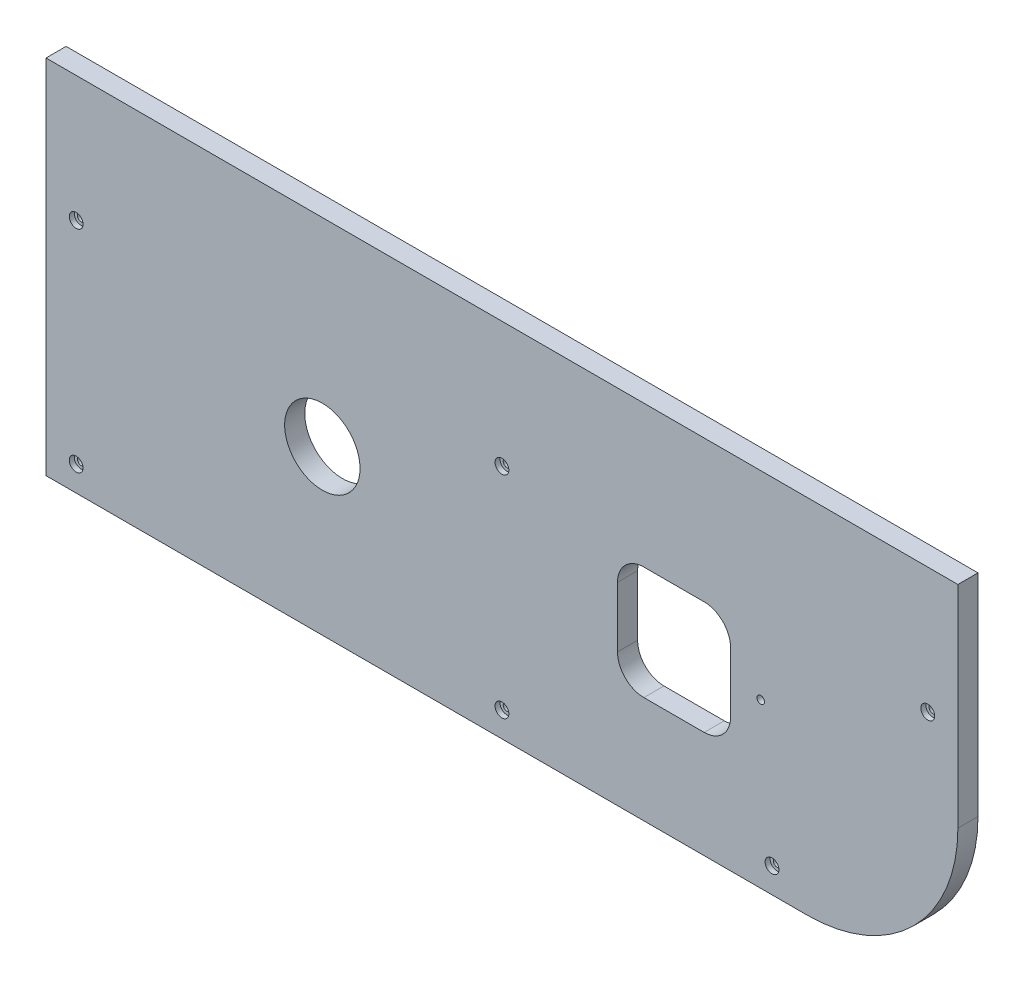
ISO-10303-21;
HEADER;
FILE_DESCRIPTION(('STEP AP214'),'2;1');
FILE_NAME('part.step','',(''),(''),'','','');
FILE_SCHEMA(('AUTOMOTIVE_DESIGN { 1 0 10303 214 1 1 1 1 }'));
ENDSEC;
DATA;
#1=APPLICATION_CONTEXT('core data for automotive mechanical design processes');
#2=APPLICATION_PROTOCOL_DEFINITION('international standard','automotive_design',2000,#1);
#3=PRODUCT_CONTEXT('',#1,'mechanical');
#4=PRODUCT('Part','Part','',(#3));
#5=PRODUCT_RELATED_PRODUCT_CATEGORY('part','',(#4));
#6=PRODUCT_DEFINITION_FORMATION('','',#4);
#7=PRODUCT_DEFINITION_CONTEXT('part definition',#1,'design');
#8=PRODUCT_DEFINITION('design','',#6,#7);
#9=PRODUCT_DEFINITION_SHAPE('','',#8);
#10=(LENGTH_UNIT() NAMED_UNIT(*) SI_UNIT(.MILLI.,.METRE.));
#11=(NAMED_UNIT(*) PLANE_ANGLE_UNIT() SI_UNIT($,.RADIAN.));
#12=(NAMED_UNIT(*) SI_UNIT($,.STERADIAN.) SOLID_ANGLE_UNIT());
#13=UNCERTAINTY_MEASURE_WITH_UNIT(LENGTH_MEASURE(1.E-05),#10,'distance_accuracy_value','');
#14=(GEOMETRIC_REPRESENTATION_CONTEXT(3) GLOBAL_UNCERTAINTY_ASSIGNED_CONTEXT((#13)) GLOBAL_UNIT_ASSIGNED_CONTEXT((#10,
#11,#12)) REPRESENTATION_CONTEXT('',''));
#15=CARTESIAN_POINT('',(0.,0.,0.));
#16=DIRECTION('',(0.,0.,1.));
#17=DIRECTION('',(1.,0.,0.));
#18=AXIS2_PLACEMENT_3D('',#15,#16,#17);
#19=CARTESIAN_POINT('',(-162.,-49.,8.));
#20=DIRECTION('',(1.,0.,0.));
#21=DIRECTION('',(0.,1.,0.));
#22=AXIS2_PLACEMENT_3D('',#19,#20,#21);
#23=PLANE('',#22);
#24=DIRECTION('',(0.,-1.,0.));
#25=VECTOR('',#24,1.);
#26=CARTESIAN_POINT('',(-162.,-49.,0.));
#27=LINE('',#26,#25);
#28=CARTESIAN_POINT('',(-162.,-49.,0.));
#29=VERTEX_POINT('',#28);
#30=CARTESIAN_POINT('',(-162.,-193.00000000004,0.));
#31=VERTEX_POINT('',#30);
#32=EDGE_CURVE('E219',#29,#31,#27,.T.);
#33=ORIENTED_EDGE('',*,*,#32,.T.);
#34=DIRECTION('',(0.,0.,-1.));
#35=VECTOR('',#34,1.);
#36=CARTESIAN_POINT('',(-162.,-193.00000000004,8.));
#37=LINE('',#36,#35);
#38=CARTESIAN_POINT('',(-162.,-193.00000000004,8.));
#39=VERTEX_POINT('',#38);
#40=EDGE_CURVE('E11',#39,#31,#37,.T.);
#41=ORIENTED_EDGE('',*,*,#40,.F.);
#42=DIRECTION('',(0.,-1.,0.));
#43=VECTOR('',#42,1.);
#44=CARTESIAN_POINT('',(-162.,-49.,8.));
#45=LINE('',#44,#43);
#46=CARTESIAN_POINT('',(-162.,-49.,8.));
#47=VERTEX_POINT('',#46);
#48=EDGE_CURVE('E206',#47,#39,#45,.T.);
#49=ORIENTED_EDGE('',*,*,#48,.F.);
#50=DIRECTION('',(0.,0.,-1.));
#51=VECTOR('',#50,1.);
#52=CARTESIAN_POINT('',(-162.,-49.,8.));
#53=LINE('',#52,#51);
#54=EDGE_CURVE('E218',#47,#29,#53,.T.);
#55=ORIENTED_EDGE('',*,*,#54,.T.);
#56=EDGE_LOOP('',(#33,#41,#49,#55));
#57=FACE_BOUND('',#56,.T.);
#58=ADVANCED_FACE('F34',(#57),#23,.F.);
#59=CARTESIAN_POINT('',(-162.,-193.00000000004,8.));
#60=DIRECTION('',(0.,1.,0.));
#61=DIRECTION('',(0.,0.,1.));
#62=AXIS2_PLACEMENT_3D('',#59,#60,#61);
#63=PLANE('',#62);
#64=DIRECTION('',(1.,0.,0.));
#65=VECTOR('',#64,1.);
#66=CARTESIAN_POINT('',(-162.,-193.00000000004,0.));
#67=LINE('',#66,#65);
#68=CARTESIAN_POINT('',(141.,-193.00000000004,0.));
#69=VERTEX_POINT('',#68);
#70=EDGE_CURVE('E222',#31,#69,#67,.T.);
#71=ORIENTED_EDGE('',*,*,#70,.T.);
#72=DIRECTION('',(0.,0.,-1.));
#73=VECTOR('',#72,1.);
#74=CARTESIAN_POINT('',(141.,-193.00000000004,8.));
#75=LINE('',#74,#73);
#76=CARTESIAN_POINT('',(141.,-193.00000000004,8.));
#77=VERTEX_POINT('',#76);
#78=EDGE_CURVE('E41',#77,#69,#75,.T.);
#79=ORIENTED_EDGE('',*,*,#78,.F.);
#80=DIRECTION('',(1.,0.,0.));
#81=VECTOR('',#80,1.);
#82=CARTESIAN_POINT('',(-162.,-193.00000000004,8.));
#83=LINE('',#82,#81);
#84=EDGE_CURVE('E209',#39,#77,#83,.T.);
#85=ORIENTED_EDGE('',*,*,#84,.F.);
#86=ORIENTED_EDGE('',*,*,#40,.T.);
#87=EDGE_LOOP('',(#71,#79,#85,#86));
#88=FACE_BOUND('',#87,.T.);
#89=ADVANCED_FACE('F261',(#88),#63,.F.);
#90=CARTESIAN_POINT('',(141.,-133.00000000004,8.));
#91=DIRECTION('',(0.,0.,-1.));
#92=DIRECTION('',(-1.,0.,0.));
#93=AXIS2_PLACEMENT_3D('',#90,#91,#92);
#94=CYLINDRICAL_SURFACE('',#93,60.);
#95=CARTESIAN_POINT('',(141.,-133.00000000004,0.));
#96=DIRECTION('',(0.,0.,1.));
#97=DIRECTION('',(1.,0.,0.));
#98=AXIS2_PLACEMENT_3D('',#95,#96,#97);
#99=CIRCLE('',#98,60.);
#100=CARTESIAN_POINT('',(201.,-133.00000000004,0.));
#101=VERTEX_POINT('',#100);
#102=EDGE_CURVE('E225',#69,#101,#99,.T.);
#103=ORIENTED_EDGE('',*,*,#102,.T.);
#104=DIRECTION('',(0.,0.,-1.));
#105=VECTOR('',#104,1.);
#106=CARTESIAN_POINT('',(201.,-133.00000000004,8.));
#107=LINE('',#106,#105);
#108=CARTESIAN_POINT('',(201.,-133.00000000004,8.));
#109=VERTEX_POINT('',#108);
#110=EDGE_CURVE('E235',#109,#101,#107,.T.);
#111=ORIENTED_EDGE('',*,*,#110,.F.);
#112=CARTESIAN_POINT('',(141.,-133.00000000004,8.));
#113=DIRECTION('',(0.,0.,1.));
#114=DIRECTION('',(1.,0.,0.));
#115=AXIS2_PLACEMENT_3D('',#112,#113,#114);
#116=CIRCLE('',#115,60.);
#117=EDGE_CURVE('E212',#77,#109,#116,.T.);
#118=ORIENTED_EDGE('',*,*,#117,.F.);
#119=ORIENTED_EDGE('',*,*,#78,.T.);
#120=EDGE_LOOP('',(#103,#111,#118,#119));
#121=FACE_BOUND('',#120,.T.);
#122=ADVANCED_FACE('F242',(#121),#94,.T.);
#123=CARTESIAN_POINT('',(201.,-49.,8.));
#124=DIRECTION('',(-1.,0.,0.));
#125=DIRECTION('',(0.,-1.,0.));
#126=AXIS2_PLACEMENT_3D('',#123,#124,#125);
#127=PLANE('',#126);
#128=DIRECTION('',(0.,1.,0.));
#129=VECTOR('',#128,1.);
#130=CARTESIAN_POINT('',(201.,-49.,0.));
#131=LINE('',#130,#129);
#132=CARTESIAN_POINT('',(201.,-49.,0.));
#133=VERTEX_POINT('',#132);
#134=EDGE_CURVE('E227',#101,#133,#131,.T.);
#135=ORIENTED_EDGE('',*,*,#134,.T.);
#136=DIRECTION('',(0.,0.,-1.));
#137=VECTOR('',#136,1.);
#138=CARTESIAN_POINT('',(201.,-49.,8.));
#139=LINE('',#138,#137);
#140=CARTESIAN_POINT('',(201.,-49.,8.));
#141=VERTEX_POINT('',#140);
#142=EDGE_CURVE('E232',#141,#133,#139,.T.);
#143=ORIENTED_EDGE('',*,*,#142,.F.);
#144=DIRECTION('',(0.,1.,0.));
#145=VECTOR('',#144,1.);
#146=CARTESIAN_POINT('',(201.,-49.,8.));
#147=LINE('',#146,#145);
#148=EDGE_CURVE('E214',#109,#141,#147,.T.);
#149=ORIENTED_EDGE('',*,*,#148,.F.);
#150=ORIENTED_EDGE('',*,*,#110,.T.);
#151=EDGE_LOOP('',(#135,#143,#149,#150));
#152=FACE_BOUND('',#151,.T.);
#153=ADVANCED_FACE('F251',(#152),#127,.F.);
#154=CARTESIAN_POINT('',(-162.,-49.,8.));
#155=DIRECTION('',(0.,-1.,0.));
#156=DIRECTION('',(1.,0.,0.));
#157=AXIS2_PLACEMENT_3D('',#154,#155,#156);
#158=PLANE('',#157);
#159=DIRECTION('',(-1.,0.,0.));
#160=VECTOR('',#159,1.);
#161=CARTESIAN_POINT('',(-162.,-49.,0.));
#162=LINE('',#161,#160);
#163=EDGE_CURVE('E210',#133,#29,#162,.T.);
#164=ORIENTED_EDGE('',*,*,#163,.T.);
#165=ORIENTED_EDGE('',*,*,#54,.F.);
#166=DIRECTION('',(-1.,0.,0.));
#167=VECTOR('',#166,1.);
#168=CARTESIAN_POINT('',(-162.,-49.,8.));
#169=LINE('',#168,#167);
#170=EDGE_CURVE('E216',#141,#47,#169,.T.);
#171=ORIENTED_EDGE('',*,*,#170,.F.);
#172=ORIENTED_EDGE('',*,*,#142,.T.);
#173=EDGE_LOOP('',(#164,#165,#171,#172));
#174=FACE_BOUND('',#173,.T.);
#175=ADVANCED_FACE('F255',(#174),#158,.F.);
#176=CARTESIAN_POINT('',(141.,-133.00000000004,8.));
#177=DIRECTION('',(0.,0.,1.));
#178=DIRECTION('',(1.,0.,0.));
#179=AXIS2_PLACEMENT_3D('',#176,#177,#178);
#180=PLANE('',#179);
#181=CARTESIAN_POINT('',(-150.,-98.9999999999999,8.));
#182=DIRECTION('',(0.,0.,1.));
#183=DIRECTION('',(1.,0.,0.));
#184=AXIS2_PLACEMENT_3D('',#181,#182,#183);
#185=CIRCLE('',#184,2.75);
#186=CARTESIAN_POINT('',(-147.25,-98.9999999999999,8.));
#187=VERTEX_POINT('',#186);
#188=EDGE_CURVE('E396',#187,#187,#185,.T.);
#189=ORIENTED_EDGE('',*,*,#188,.F.);
#190=EDGE_LOOP('',(#189));
#191=FACE_BOUND('',#190,.T.);
#192=CARTESIAN_POINT('',(19.5,-98.9999999999999,8.));
#193=DIRECTION('',(0.,0.,1.));
#194=DIRECTION('',(1.,0.,0.));
#195=AXIS2_PLACEMENT_3D('',#192,#193,#194);
#196=CIRCLE('',#195,2.75);
#197=CARTESIAN_POINT('',(22.25,-98.9999999999999,8.));
#198=VERTEX_POINT('',#197);
#199=EDGE_CURVE('E406',#198,#198,#196,.T.);
#200=ORIENTED_EDGE('',*,*,#199,.F.);
#201=EDGE_LOOP('',(#200));
#202=FACE_BOUND('',#201,.T.);
#203=CARTESIAN_POINT('',(189.,-98.9999999999999,8.));
#204=DIRECTION('',(0.,0.,1.));
#205=DIRECTION('',(1.,0.,0.));
#206=AXIS2_PLACEMENT_3D('',#203,#204,#205);
#207=CIRCLE('',#206,2.75);
#208=CARTESIAN_POINT('',(191.75,-98.9999999999999,8.));
#209=VERTEX_POINT('',#208);
#210=EDGE_CURVE('E418',#209,#209,#207,.T.);
#211=ORIENTED_EDGE('',*,*,#210,.F.);
#212=EDGE_LOOP('',(#211));
#213=FACE_BOUND('',#212,.T.);
#214=CARTESIAN_POINT('',(-150.,-183.00000000004,8.));
#215=DIRECTION('',(0.,0.,1.));
#216=DIRECTION('',(1.,0.,0.));
#217=AXIS2_PLACEMENT_3D('',#214,#215,#216);
#218=CIRCLE('',#217,2.75);
#219=CARTESIAN_POINT('',(-147.25,-183.00000000004,8.));
#220=VERTEX_POINT('',#219);
#221=EDGE_CURVE('E430',#220,#220,#218,.T.);
#222=ORIENTED_EDGE('',*,*,#221,.F.);
#223=EDGE_LOOP('',(#222));
#224=FACE_BOUND('',#223,.T.);
#225=CARTESIAN_POINT('',(19.5,-183.00000000004,8.));
#226=DIRECTION('',(0.,0.,1.));
#227=DIRECTION('',(1.,0.,0.));
#228=AXIS2_PLACEMENT_3D('',#225,#226,#227);
#229=CIRCLE('',#228,2.75);
#230=CARTESIAN_POINT('',(22.25,-183.00000000004,8.));
#231=VERTEX_POINT('',#230);
#232=EDGE_CURVE('E442',#231,#231,#229,.T.);
#233=ORIENTED_EDGE('',*,*,#232,.F.);
#234=EDGE_LOOP('',(#233));
#235=FACE_BOUND('',#234,.T.);
#236=CARTESIAN_POINT('',(127.,-183.00000000004,8.));
#237=DIRECTION('',(0.,0.,1.));
#238=DIRECTION('',(1.,0.,0.));
#239=AXIS2_PLACEMENT_3D('',#236,#237,#238);
#240=CIRCLE('',#239,2.75);
#241=CARTESIAN_POINT('',(129.75,-183.00000000004,8.));
#242=VERTEX_POINT('',#241);
#243=EDGE_CURVE('E454',#242,#242,#240,.T.);
#244=ORIENTED_EDGE('',*,*,#243,.F.);
#245=EDGE_LOOP('',(#244));
#246=FACE_BOUND('',#245,.T.);
#247=CARTESIAN_POINT('',(-52.0000000000001,-128.00000000002,8.));
#248=DIRECTION('',(0.,0.,1.));
#249=DIRECTION('',(1.,0.,0.));
#250=AXIS2_PLACEMENT_3D('',#247,#248,#249);
#251=CIRCLE('',#250,15.);
#252=CARTESIAN_POINT('',(-37.0000000000001,-128.00000000002,8.));
#253=VERTEX_POINT('',#252);
#254=EDGE_CURVE('E153',#253,#253,#251,.T.);
#255=ORIENTED_EDGE('',*,*,#254,.F.);
#256=EDGE_LOOP('',(#255));
#257=FACE_BOUND('',#256,.T.);
#258=CARTESIAN_POINT('',(75.9999999999999,-140.00000000002,8.));
#259=DIRECTION('',(0.,0.,1.));
#260=DIRECTION('',(1.,0.,0.));
#261=AXIS2_PLACEMENT_3D('',#258,#259,#260);
#262=CIRCLE('',#261,10.5);
#263=CARTESIAN_POINT('',(65.4999999999999,-140.00000000002,8.));
#264=VERTEX_POINT('',#263);
#265=CARTESIAN_POINT('',(75.9999999999999,-150.50000000002,8.));
#266=VERTEX_POINT('',#265);
#267=EDGE_CURVE('E48',#264,#266,#262,.T.);
#268=ORIENTED_EDGE('',*,*,#267,.F.);
#269=DIRECTION('',(0.,-1.,0.));
#270=VECTOR('',#269,1.);
#271=CARTESIAN_POINT('',(65.4999999999999,-116.00000000002,8.));
#272=LINE('',#271,#270);
#273=CARTESIAN_POINT('',(65.4999999999999,-116.00000000002,8.));
#274=VERTEX_POINT('',#273);
#275=EDGE_CURVE('E147',#274,#264,#272,.T.);
#276=ORIENTED_EDGE('',*,*,#275,.F.);
#277=CARTESIAN_POINT('',(75.9999999999999,-116.00000000002,8.));
#278=DIRECTION('',(0.,0.,1.));
#279=DIRECTION('',(1.,0.,0.));
#280=AXIS2_PLACEMENT_3D('',#277,#278,#279);
#281=CIRCLE('',#280,10.5);
#282=CARTESIAN_POINT('',(76.,-105.50000000002,8.));
#283=VERTEX_POINT('',#282);
#284=EDGE_CURVE('E150',#283,#274,#281,.T.);
#285=ORIENTED_EDGE('',*,*,#284,.F.);
#286=DIRECTION('',(-1.,0.,0.));
#287=VECTOR('',#286,1.);
#288=CARTESIAN_POINT('',(99.9999999999998,-105.50000000002,8.));
#289=LINE('',#288,#287);
#290=CARTESIAN_POINT('',(99.9999999999998,-105.50000000002,8.));
#291=VERTEX_POINT('',#290);
#292=EDGE_CURVE('E182',#291,#283,#289,.T.);
#293=ORIENTED_EDGE('',*,*,#292,.F.);
#294=CARTESIAN_POINT('',(99.9999999999998,-116.00000000002,8.));
#295=DIRECTION('',(0.,0.,1.));
#296=DIRECTION('',(1.,0.,0.));
#297=AXIS2_PLACEMENT_3D('',#294,#295,#296);
#298=CIRCLE('',#297,10.5);
#299=CARTESIAN_POINT('',(110.5,-116.00000000002,8.));
#300=VERTEX_POINT('',#299);
#301=EDGE_CURVE('E179',#300,#291,#298,.T.);
#302=ORIENTED_EDGE('',*,*,#301,.F.);
#303=DIRECTION('',(0.,1.,0.));
#304=VECTOR('',#303,1.);
#305=CARTESIAN_POINT('',(110.5,-140.00000000002,8.));
#306=LINE('',#305,#304);
#307=CARTESIAN_POINT('',(110.5,-140.00000000002,8.));
#308=VERTEX_POINT('',#307);
#309=EDGE_CURVE('E176',#308,#300,#306,.T.);
#310=ORIENTED_EDGE('',*,*,#309,.F.);
#311=CARTESIAN_POINT('',(99.9999999999998,-140.00000000002,8.));
#312=DIRECTION('',(0.,0.,1.));
#313=DIRECTION('',(1.,0.,0.));
#314=AXIS2_PLACEMENT_3D('',#311,#312,#313);
#315=CIRCLE('',#314,10.5);
#316=CARTESIAN_POINT('',(99.9999999999998,-150.50000000002,8.));
#317=VERTEX_POINT('',#316);
#318=EDGE_CURVE('E173',#317,#308,#315,.T.);
#319=ORIENTED_EDGE('',*,*,#318,.F.);
#320=DIRECTION('',(1.,0.,0.));
#321=VECTOR('',#320,1.);
#322=CARTESIAN_POINT('',(75.9999999999999,-150.50000000002,8.));
#323=LINE('',#322,#321);
#324=EDGE_CURVE('E170',#266,#317,#323,.T.);
#325=ORIENTED_EDGE('',*,*,#324,.F.);
#326=EDGE_LOOP('',(#268,#276,#285,#293,#302,#310,#319,#325));
#327=FACE_BOUND('',#326,.T.);
#328=CARTESIAN_POINT('',(122.5,-128.00000000002,8.));
#329=DIRECTION('',(0.,0.,1.));
#330=DIRECTION('',(1.,0.,0.));
#331=AXIS2_PLACEMENT_3D('',#328,#329,#330);
#332=CIRCLE('',#331,1.5);
#333=CARTESIAN_POINT('',(124.,-128.00000000002,8.));
#334=VERTEX_POINT('',#333);
#335=EDGE_CURVE('E202',#334,#334,#332,.T.);
#336=ORIENTED_EDGE('',*,*,#335,.F.);
#337=EDGE_LOOP('',(#336));
#338=FACE_BOUND('',#337,.T.);
#339=ORIENTED_EDGE('',*,*,#48,.T.);
#340=ORIENTED_EDGE('',*,*,#84,.T.);
#341=ORIENTED_EDGE('',*,*,#117,.T.);
#342=ORIENTED_EDGE('',*,*,#148,.T.);
#343=ORIENTED_EDGE('',*,*,#170,.T.);
#344=EDGE_LOOP('',(#339,#340,#341,#342,#343));
#345=FACE_BOUND('',#344,.T.);
#346=ADVANCED_FACE('F259',(#191,#202,#213,#224,#235,#246,#257,#327,#338,#345),#180,.T.);
#347=CARTESIAN_POINT('',(141.,-133.00000000004,0.));
#348=DIRECTION('',(0.,0.,1.));
#349=DIRECTION('',(1.,0.,0.));
#350=AXIS2_PLACEMENT_3D('',#347,#348,#349);
#351=PLANE('',#350);
#352=CARTESIAN_POINT('',(-150.,-98.9999999999999,0.));
#353=DIRECTION('',(0.,0.,1.));
#354=DIRECTION('',(1.,0.,0.));
#355=AXIS2_PLACEMENT_3D('',#352,#353,#354);
#356=CIRCLE('',#355,1.5);
#357=CARTESIAN_POINT('',(-148.5,-98.9999999999999,0.));
#358=VERTEX_POINT('',#357);
#359=EDGE_CURVE('E403',#358,#358,#356,.T.);
#360=ORIENTED_EDGE('',*,*,#359,.T.);
#361=EDGE_LOOP('',(#360));
#362=FACE_BOUND('',#361,.T.);
#363=CARTESIAN_POINT('',(19.5,-98.9999999999999,0.));
#364=DIRECTION('',(0.,0.,1.));
#365=DIRECTION('',(1.,0.,0.));
#366=AXIS2_PLACEMENT_3D('',#363,#364,#365);
#367=CIRCLE('',#366,1.5);
#368=CARTESIAN_POINT('',(21.,-98.9999999999999,0.));
#369=VERTEX_POINT('',#368);
#370=EDGE_CURVE('E415',#369,#369,#367,.T.);
#371=ORIENTED_EDGE('',*,*,#370,.T.);
#372=EDGE_LOOP('',(#371));
#373=FACE_BOUND('',#372,.T.);
#374=CARTESIAN_POINT('',(189.,-98.9999999999999,0.));
#375=DIRECTION('',(0.,0.,1.));
#376=DIRECTION('',(1.,0.,0.));
#377=AXIS2_PLACEMENT_3D('',#374,#375,#376);
#378=CIRCLE('',#377,1.5);
#379=CARTESIAN_POINT('',(190.5,-98.9999999999999,0.));
#380=VERTEX_POINT('',#379);
#381=EDGE_CURVE('E427',#380,#380,#378,.T.);
#382=ORIENTED_EDGE('',*,*,#381,.T.);
#383=EDGE_LOOP('',(#382));
#384=FACE_BOUND('',#383,.T.);
#385=CARTESIAN_POINT('',(-150.,-183.00000000004,0.));
#386=DIRECTION('',(0.,0.,1.));
#387=DIRECTION('',(1.,0.,0.));
#388=AXIS2_PLACEMENT_3D('',#385,#386,#387);
#389=CIRCLE('',#388,1.5);
#390=CARTESIAN_POINT('',(-148.5,-183.00000000004,0.));
#391=VERTEX_POINT('',#390);
#392=EDGE_CURVE('E439',#391,#391,#389,.T.);
#393=ORIENTED_EDGE('',*,*,#392,.T.);
#394=EDGE_LOOP('',(#393));
#395=FACE_BOUND('',#394,.T.);
#396=CARTESIAN_POINT('',(19.5,-183.00000000004,0.));
#397=DIRECTION('',(0.,0.,1.));
#398=DIRECTION('',(1.,0.,0.));
#399=AXIS2_PLACEMENT_3D('',#396,#397,#398);
#400=CIRCLE('',#399,1.5);
#401=CARTESIAN_POINT('',(21.,-183.00000000004,0.));
#402=VERTEX_POINT('',#401);
#403=EDGE_CURVE('E451',#402,#402,#400,.T.);
#404=ORIENTED_EDGE('',*,*,#403,.T.);
#405=EDGE_LOOP('',(#404));
#406=FACE_BOUND('',#405,.T.);
#407=CARTESIAN_POINT('',(127.,-183.00000000004,0.));
#408=DIRECTION('',(0.,0.,1.));
#409=DIRECTION('',(1.,0.,0.));
#410=AXIS2_PLACEMENT_3D('',#407,#408,#409);
#411=CIRCLE('',#410,1.5);
#412=CARTESIAN_POINT('',(128.5,-183.00000000004,0.));
#413=VERTEX_POINT('',#412);
#414=EDGE_CURVE('E205',#413,#413,#411,.T.);
#415=ORIENTED_EDGE('',*,*,#414,.T.);
#416=EDGE_LOOP('',(#415));
#417=FACE_BOUND('',#416,.T.);
#418=CARTESIAN_POINT('',(-52.0000000000001,-128.00000000002,0.));
#419=DIRECTION('',(0.,0.,1.));
#420=DIRECTION('',(1.,0.,0.));
#421=AXIS2_PLACEMENT_3D('',#418,#419,#420);
#422=CIRCLE('',#421,15.);
#423=CARTESIAN_POINT('',(-37.0000000000001,-128.00000000002,0.));
#424=VERTEX_POINT('',#423);
#425=EDGE_CURVE('E223',#424,#424,#422,.T.);
#426=ORIENTED_EDGE('',*,*,#425,.T.);
#427=EDGE_LOOP('',(#426));
#428=FACE_BOUND('',#427,.T.);
#429=DIRECTION('',(0.,-1.,0.));
#430=VECTOR('',#429,1.);
#431=CARTESIAN_POINT('',(65.4999999999999,-116.00000000002,0.));
#432=LINE('',#431,#430);
#433=CARTESIAN_POINT('',(65.4999999999999,-116.00000000002,0.));
#434=VERTEX_POINT('',#433);
#435=CARTESIAN_POINT('',(65.4999999999999,-140.00000000002,0.));
#436=VERTEX_POINT('',#435);
#437=EDGE_CURVE('E136',#434,#436,#432,.T.);
#438=ORIENTED_EDGE('',*,*,#437,.T.);
#439=CARTESIAN_POINT('',(75.9999999999999,-140.00000000002,0.));
#440=DIRECTION('',(0.,0.,1.));
#441=DIRECTION('',(1.,0.,0.));
#442=AXIS2_PLACEMENT_3D('',#439,#440,#441);
#443=CIRCLE('',#442,10.5);
#444=CARTESIAN_POINT('',(75.9999999999999,-150.50000000002,0.));
#445=VERTEX_POINT('',#444);
#446=EDGE_CURVE('E130',#436,#445,#443,.T.);
#447=ORIENTED_EDGE('',*,*,#446,.T.);
#448=DIRECTION('',(1.,0.,0.));
#449=VECTOR('',#448,1.);
#450=CARTESIAN_POINT('',(75.9999999999999,-150.50000000002,0.));
#451=LINE('',#450,#449);
#452=CARTESIAN_POINT('',(99.9999999999998,-150.50000000002,0.));
#453=VERTEX_POINT('',#452);
#454=EDGE_CURVE('E139',#445,#453,#451,.T.);
#455=ORIENTED_EDGE('',*,*,#454,.T.);
#456=CARTESIAN_POINT('',(99.9999999999998,-140.00000000002,0.));
#457=DIRECTION('',(0.,0.,1.));
#458=DIRECTION('',(1.,0.,0.));
#459=AXIS2_PLACEMENT_3D('',#456,#457,#458);
#460=CIRCLE('',#459,10.5);
#461=CARTESIAN_POINT('',(110.5,-140.00000000002,0.));
#462=VERTEX_POINT('',#461);
#463=EDGE_CURVE('E56',#453,#462,#460,.T.);
#464=ORIENTED_EDGE('',*,*,#463,.T.);
#465=DIRECTION('',(0.,1.,0.));
#466=VECTOR('',#465,1.);
#467=CARTESIAN_POINT('',(110.5,-140.00000000002,0.));
#468=LINE('',#467,#466);
#469=CARTESIAN_POINT('',(110.5,-116.00000000002,0.));
#470=VERTEX_POINT('',#469);
#471=EDGE_CURVE('E157',#462,#470,#468,.T.);
#472=ORIENTED_EDGE('',*,*,#471,.T.);
#473=CARTESIAN_POINT('',(99.9999999999998,-116.00000000002,0.));
#474=DIRECTION('',(0.,0.,1.));
#475=DIRECTION('',(1.,0.,0.));
#476=AXIS2_PLACEMENT_3D('',#473,#474,#475);
#477=CIRCLE('',#476,10.5);
#478=CARTESIAN_POINT('',(99.9999999999998,-105.50000000002,0.));
#479=VERTEX_POINT('',#478);
#480=EDGE_CURVE('E160',#470,#479,#477,.T.);
#481=ORIENTED_EDGE('',*,*,#480,.T.);
#482=DIRECTION('',(-1.,0.,0.));
#483=VECTOR('',#482,1.);
#484=CARTESIAN_POINT('',(99.9999999999998,-105.50000000002,0.));
#485=LINE('',#484,#483);
#486=CARTESIAN_POINT('',(76.,-105.50000000002,0.));
#487=VERTEX_POINT('',#486);
#488=EDGE_CURVE('E163',#479,#487,#485,.T.);
#489=ORIENTED_EDGE('',*,*,#488,.T.);
#490=CARTESIAN_POINT('',(75.9999999999999,-116.00000000002,0.));
#491=DIRECTION('',(0.,0.,1.));
#492=DIRECTION('',(1.,0.,0.));
#493=AXIS2_PLACEMENT_3D('',#490,#491,#492);
#494=CIRCLE('',#493,10.5);
#495=EDGE_CURVE('E166',#487,#434,#494,.T.);
#496=ORIENTED_EDGE('',*,*,#495,.T.);
#497=EDGE_LOOP('',(#438,#447,#455,#464,#472,#481,#489,#496));
#498=FACE_BOUND('',#497,.T.);
#499=CARTESIAN_POINT('',(122.5,-128.00000000002,0.));
#500=DIRECTION('',(0.,0.,1.));
#501=DIRECTION('',(1.,0.,0.));
#502=AXIS2_PLACEMENT_3D('',#499,#500,#501);
#503=CIRCLE('',#502,1.5);
#504=CARTESIAN_POINT('',(124.,-128.00000000002,0.));
#505=VERTEX_POINT('',#504);
#506=EDGE_CURVE('E171',#505,#505,#503,.T.);
#507=ORIENTED_EDGE('',*,*,#506,.T.);
#508=EDGE_LOOP('',(#507));
#509=FACE_BOUND('',#508,.T.);
#510=ORIENTED_EDGE('',*,*,#32,.F.);
#511=ORIENTED_EDGE('',*,*,#163,.F.);
#512=ORIENTED_EDGE('',*,*,#134,.F.);
#513=ORIENTED_EDGE('',*,*,#102,.F.);
#514=ORIENTED_EDGE('',*,*,#70,.F.);
#515=EDGE_LOOP('',(#510,#511,#512,#513,#514));
#516=FACE_BOUND('',#515,.T.);
#517=ADVANCED_FACE('F143',(#362,#373,#384,#395,#406,#417,#428,#498,#509,#516),#351,.F.);
#518=CARTESIAN_POINT('',(122.5,-128.00000000002,0.));
#519=DIRECTION('',(0.,0.,1.));
#520=DIRECTION('',(1.,0.,0.));
#521=AXIS2_PLACEMENT_3D('',#518,#519,#520);
#522=CYLINDRICAL_SURFACE('',#521,1.5);
#523=ORIENTED_EDGE('',*,*,#506,.F.);
#524=EDGE_LOOP('',(#523));
#525=FACE_BOUND('',#524,.T.);
#526=ORIENTED_EDGE('',*,*,#335,.T.);
#527=EDGE_LOOP('',(#526));
#528=FACE_BOUND('',#527,.T.);
#529=ADVANCED_FACE('F278',(#525,#528),#522,.F.);
#530=CARTESIAN_POINT('',(75.9999999999999,-140.00000000002,0.));
#531=DIRECTION('',(0.,0.,1.));
#532=DIRECTION('',(1.,0.,0.));
#533=AXIS2_PLACEMENT_3D('',#530,#531,#532);
#534=CYLINDRICAL_SURFACE('',#533,10.5);
#535=ORIENTED_EDGE('',*,*,#267,.T.);
#536=DIRECTION('',(0.,0.,1.));
#537=VECTOR('',#536,1.);
#538=CARTESIAN_POINT('',(75.9999999999999,-150.50000000002,0.));
#539=LINE('',#538,#537);
#540=EDGE_CURVE('E126',#445,#266,#539,.T.);
#541=ORIENTED_EDGE('',*,*,#540,.F.);
#542=ORIENTED_EDGE('',*,*,#446,.F.);
#543=DIRECTION('',(0.,0.,1.));
#544=VECTOR('',#543,1.);
#545=CARTESIAN_POINT('',(65.4999999999999,-140.00000000002,0.));
#546=LINE('',#545,#544);
#547=EDGE_CURVE('E187',#436,#264,#546,.T.);
#548=ORIENTED_EDGE('',*,*,#547,.T.);
#549=EDGE_LOOP('',(#535,#541,#542,#548));
#550=FACE_BOUND('',#549,.T.);
#551=ADVANCED_FACE('F128',(#550),#534,.F.);
#552=CARTESIAN_POINT('',(65.4999999999999,-116.00000000002,0.));
#553=DIRECTION('',(-1.,0.,0.));
#554=DIRECTION('',(0.,0.,1.));
#555=AXIS2_PLACEMENT_3D('',#552,#553,#554);
#556=PLANE('',#555);
#557=ORIENTED_EDGE('',*,*,#275,.T.);
#558=ORIENTED_EDGE('',*,*,#547,.F.);
#559=ORIENTED_EDGE('',*,*,#437,.F.);
#560=DIRECTION('',(0.,0.,1.));
#561=VECTOR('',#560,1.);
#562=CARTESIAN_POINT('',(65.4999999999999,-116.00000000002,0.));
#563=LINE('',#562,#561);
#564=EDGE_CURVE('E189',#434,#274,#563,.T.);
#565=ORIENTED_EDGE('',*,*,#564,.T.);
#566=EDGE_LOOP('',(#557,#558,#559,#565));
#567=FACE_BOUND('',#566,.T.);
#568=ADVANCED_FACE('F288',(#567),#556,.F.);
#569=CARTESIAN_POINT('',(75.9999999999999,-116.00000000002,0.));
#570=DIRECTION('',(0.,0.,1.));
#571=DIRECTION('',(1.,0.,0.));
#572=AXIS2_PLACEMENT_3D('',#569,#570,#571);
#573=CYLINDRICAL_SURFACE('',#572,10.5);
#574=ORIENTED_EDGE('',*,*,#284,.T.);
#575=ORIENTED_EDGE('',*,*,#564,.F.);
#576=ORIENTED_EDGE('',*,*,#495,.F.);
#577=DIRECTION('',(0.,0.,1.));
#578=VECTOR('',#577,1.);
#579=CARTESIAN_POINT('',(76.,-105.50000000002,0.));
#580=LINE('',#579,#578);
#581=EDGE_CURVE('E191',#487,#283,#580,.T.);
#582=ORIENTED_EDGE('',*,*,#581,.T.);
#583=EDGE_LOOP('',(#574,#575,#576,#582));
#584=FACE_BOUND('',#583,.T.);
#585=ADVANCED_FACE('F306',(#584),#573,.F.);
#586=CARTESIAN_POINT('',(99.9999999999998,-105.50000000002,0.));
#587=DIRECTION('',(0.,1.,0.));
#588=DIRECTION('',(0.,0.,1.));
#589=AXIS2_PLACEMENT_3D('',#586,#587,#588);
#590=PLANE('',#589);
#591=ORIENTED_EDGE('',*,*,#292,.T.);
#592=ORIENTED_EDGE('',*,*,#581,.F.);
#593=ORIENTED_EDGE('',*,*,#488,.F.);
#594=DIRECTION('',(0.,0.,1.));
#595=VECTOR('',#594,1.);
#596=CARTESIAN_POINT('',(99.9999999999998,-105.50000000002,0.));
#597=LINE('',#596,#595);
#598=EDGE_CURVE('E193',#479,#291,#597,.T.);
#599=ORIENTED_EDGE('',*,*,#598,.T.);
#600=EDGE_LOOP('',(#591,#592,#593,#599));
#601=FACE_BOUND('',#600,.T.);
#602=ADVANCED_FACE('F302',(#601),#590,.F.);
#603=CARTESIAN_POINT('',(99.9999999999998,-116.00000000002,0.));
#604=DIRECTION('',(0.,0.,1.));
#605=DIRECTION('',(1.,0.,0.));
#606=AXIS2_PLACEMENT_3D('',#603,#604,#605);
#607=CYLINDRICAL_SURFACE('',#606,10.5);
#608=ORIENTED_EDGE('',*,*,#301,.T.);
#609=ORIENTED_EDGE('',*,*,#598,.F.);
#610=ORIENTED_EDGE('',*,*,#480,.F.);
#611=DIRECTION('',(0.,0.,1.));
#612=VECTOR('',#611,1.);
#613=CARTESIAN_POINT('',(110.5,-116.00000000002,0.));
#614=LINE('',#613,#612);
#615=EDGE_CURVE('E195',#470,#300,#614,.T.);
#616=ORIENTED_EDGE('',*,*,#615,.T.);
#617=EDGE_LOOP('',(#608,#609,#610,#616));
#618=FACE_BOUND('',#617,.T.);
#619=ADVANCED_FACE('F298',(#618),#607,.F.);
#620=CARTESIAN_POINT('',(110.5,-140.00000000002,0.));
#621=DIRECTION('',(1.,0.,0.));
#622=DIRECTION('',(0.,0.,-1.));
#623=AXIS2_PLACEMENT_3D('',#620,#621,#622);
#624=PLANE('',#623);
#625=ORIENTED_EDGE('',*,*,#309,.T.);
#626=ORIENTED_EDGE('',*,*,#615,.F.);
#627=ORIENTED_EDGE('',*,*,#471,.F.);
#628=DIRECTION('',(0.,0.,1.));
#629=VECTOR('',#628,1.);
#630=CARTESIAN_POINT('',(110.5,-140.00000000002,0.));
#631=LINE('',#630,#629);
#632=EDGE_CURVE('E197',#462,#308,#631,.T.);
#633=ORIENTED_EDGE('',*,*,#632,.T.);
#634=EDGE_LOOP('',(#625,#626,#627,#633));
#635=FACE_BOUND('',#634,.T.);
#636=ADVANCED_FACE('F295',(#635),#624,.F.);
#637=CARTESIAN_POINT('',(99.9999999999998,-140.00000000002,0.));
#638=DIRECTION('',(0.,0.,1.));
#639=DIRECTION('',(1.,0.,0.));
#640=AXIS2_PLACEMENT_3D('',#637,#638,#639);
#641=CYLINDRICAL_SURFACE('',#640,10.5);
#642=ORIENTED_EDGE('',*,*,#318,.T.);
#643=ORIENTED_EDGE('',*,*,#632,.F.);
#644=ORIENTED_EDGE('',*,*,#463,.F.);
#645=DIRECTION('',(0.,0.,1.));
#646=VECTOR('',#645,1.);
#647=CARTESIAN_POINT('',(99.9999999999998,-150.50000000002,0.));
#648=LINE('',#647,#646);
#649=EDGE_CURVE('E135',#453,#317,#648,.T.);
#650=ORIENTED_EDGE('',*,*,#649,.T.);
#651=EDGE_LOOP('',(#642,#643,#644,#650));
#652=FACE_BOUND('',#651,.T.);
#653=ADVANCED_FACE('F292',(#652),#641,.F.);
#654=CARTESIAN_POINT('',(75.9999999999999,-150.50000000002,0.));
#655=DIRECTION('',(0.,-1.,0.));
#656=DIRECTION('',(1.,0.,0.));
#657=AXIS2_PLACEMENT_3D('',#654,#655,#656);
#658=PLANE('',#657);
#659=ORIENTED_EDGE('',*,*,#324,.T.);
#660=ORIENTED_EDGE('',*,*,#649,.F.);
#661=ORIENTED_EDGE('',*,*,#454,.F.);
#662=ORIENTED_EDGE('',*,*,#540,.T.);
#663=EDGE_LOOP('',(#659,#660,#661,#662));
#664=FACE_BOUND('',#663,.T.);
#665=ADVANCED_FACE('F140',(#664),#658,.F.);
#666=CARTESIAN_POINT('',(-52.0000000000001,-128.00000000002,0.));
#667=DIRECTION('',(0.,0.,1.));
#668=DIRECTION('',(1.,0.,0.));
#669=AXIS2_PLACEMENT_3D('',#666,#667,#668);
#670=CYLINDRICAL_SURFACE('',#669,15.);
#671=ORIENTED_EDGE('',*,*,#425,.F.);
#672=EDGE_LOOP('',(#671));
#673=FACE_BOUND('',#672,.T.);
#674=ORIENTED_EDGE('',*,*,#254,.T.);
#675=EDGE_LOOP('',(#674));
#676=FACE_BOUND('',#675,.T.);
#677=ADVANCED_FACE('F291',(#673,#676),#670,.F.);
#678=CARTESIAN_POINT('',(127.,-183.00000000004,8.));
#679=DIRECTION('',(0.,0.,1.));
#680=DIRECTION('',(1.,0.,0.));
#681=AXIS2_PLACEMENT_3D('',#678,#679,#680);
#682=CYLINDRICAL_SURFACE('',#681,1.5);
#683=ORIENTED_EDGE('',*,*,#414,.F.);
#684=EDGE_LOOP('',(#683));
#685=FACE_BOUND('',#684,.T.);
#686=CARTESIAN_POINT('',(127.,-183.00000000004,6.));
#687=DIRECTION('',(0.,0.,1.));
#688=DIRECTION('',(1.,0.,0.));
#689=AXIS2_PLACEMENT_3D('',#686,#687,#688);
#690=CIRCLE('',#689,1.5);
#691=CARTESIAN_POINT('',(128.5,-183.00000000004,6.));
#692=VERTEX_POINT('',#691);
#693=EDGE_CURVE('E460',#692,#692,#690,.T.);
#694=ORIENTED_EDGE('',*,*,#693,.T.);
#695=EDGE_LOOP('',(#694));
#696=FACE_BOUND('',#695,.T.);
#697=ADVANCED_FACE('F316',(#685,#696),#682,.F.);
#698=CARTESIAN_POINT('',(128.5,-183.00000000004,6.));
#699=DIRECTION('',(0.,0.,-1.));
#700=DIRECTION('',(-1.,0.,0.));
#701=AXIS2_PLACEMENT_3D('',#698,#699,#700);
#702=PLANE('',#701);
#703=ORIENTED_EDGE('',*,*,#693,.F.);
#704=EDGE_LOOP('',(#703));
#705=FACE_BOUND('',#704,.T.);
#706=CARTESIAN_POINT('',(127.,-183.00000000004,6.));
#707=DIRECTION('',(0.,0.,1.));
#708=DIRECTION('',(1.,0.,0.));
#709=AXIS2_PLACEMENT_3D('',#706,#707,#708);
#710=CIRCLE('',#709,2.75);
#711=CARTESIAN_POINT('',(129.75,-183.00000000004,6.));
#712=VERTEX_POINT('',#711);
#713=EDGE_CURVE('E457',#712,#712,#710,.T.);
#714=ORIENTED_EDGE('',*,*,#713,.T.);
#715=EDGE_LOOP('',(#714));
#716=FACE_BOUND('',#715,.T.);
#717=ADVANCED_FACE('F320',(#705,#716),#702,.F.);
#718=CARTESIAN_POINT('',(127.,-183.00000000004,8.));
#719=DIRECTION('',(0.,0.,1.));
#720=DIRECTION('',(1.,0.,0.));
#721=AXIS2_PLACEMENT_3D('',#718,#719,#720);
#722=CYLINDRICAL_SURFACE('',#721,2.75);
#723=ORIENTED_EDGE('',*,*,#713,.F.);
#724=EDGE_LOOP('',(#723));
#725=FACE_BOUND('',#724,.T.);
#726=ORIENTED_EDGE('',*,*,#243,.T.);
#727=EDGE_LOOP('',(#726));
#728=FACE_BOUND('',#727,.T.);
#729=ADVANCED_FACE('F324',(#725,#728),#722,.F.);
#730=CARTESIAN_POINT('',(19.5,-183.00000000004,8.));
#731=DIRECTION('',(0.,0.,1.));
#732=DIRECTION('',(1.,0.,0.));
#733=AXIS2_PLACEMENT_3D('',#730,#731,#732);
#734=CYLINDRICAL_SURFACE('',#733,1.5);
#735=ORIENTED_EDGE('',*,*,#403,.F.);
#736=EDGE_LOOP('',(#735));
#737=FACE_BOUND('',#736,.T.);
#738=CARTESIAN_POINT('',(19.5,-183.00000000004,6.));
#739=DIRECTION('',(0.,0.,1.));
#740=DIRECTION('',(1.,0.,0.));
#741=AXIS2_PLACEMENT_3D('',#738,#739,#740);
#742=CIRCLE('',#741,1.5);
#743=CARTESIAN_POINT('',(21.,-183.00000000004,6.));
#744=VERTEX_POINT('',#743);
#745=EDGE_CURVE('E448',#744,#744,#742,.T.);
#746=ORIENTED_EDGE('',*,*,#745,.T.);
#747=EDGE_LOOP('',(#746));
#748=FACE_BOUND('',#747,.T.);
#749=ADVANCED_FACE('F328',(#737,#748),#734,.F.);
#750=CARTESIAN_POINT('',(21.,-183.00000000004,6.));
#751=DIRECTION('',(0.,0.,-1.));
#752=DIRECTION('',(-1.,0.,0.));
#753=AXIS2_PLACEMENT_3D('',#750,#751,#752);
#754=PLANE('',#753);
#755=ORIENTED_EDGE('',*,*,#745,.F.);
#756=EDGE_LOOP('',(#755));
#757=FACE_BOUND('',#756,.T.);
#758=CARTESIAN_POINT('',(19.5,-183.00000000004,6.));
#759=DIRECTION('',(0.,0.,1.));
#760=DIRECTION('',(1.,0.,0.));
#761=AXIS2_PLACEMENT_3D('',#758,#759,#760);
#762=CIRCLE('',#761,2.75);
#763=CARTESIAN_POINT('',(22.25,-183.00000000004,6.));
#764=VERTEX_POINT('',#763);
#765=EDGE_CURVE('E445',#764,#764,#762,.T.);
#766=ORIENTED_EDGE('',*,*,#765,.T.);
#767=EDGE_LOOP('',(#766));
#768=FACE_BOUND('',#767,.T.);
#769=ADVANCED_FACE('F332',(#757,#768),#754,.F.);
#770=CARTESIAN_POINT('',(19.5,-183.00000000004,8.));
#771=DIRECTION('',(0.,0.,1.));
#772=DIRECTION('',(1.,0.,0.));
#773=AXIS2_PLACEMENT_3D('',#770,#771,#772);
#774=CYLINDRICAL_SURFACE('',#773,2.75);
#775=ORIENTED_EDGE('',*,*,#765,.F.);
#776=EDGE_LOOP('',(#775));
#777=FACE_BOUND('',#776,.T.);
#778=ORIENTED_EDGE('',*,*,#232,.T.);
#779=EDGE_LOOP('',(#778));
#780=FACE_BOUND('',#779,.T.);
#781=ADVANCED_FACE('F336',(#777,#780),#774,.F.);
#782=CARTESIAN_POINT('',(-150.,-183.00000000004,8.));
#783=DIRECTION('',(0.,0.,1.));
#784=DIRECTION('',(1.,0.,0.));
#785=AXIS2_PLACEMENT_3D('',#782,#783,#784);
#786=CYLINDRICAL_SURFACE('',#785,1.5);
#787=ORIENTED_EDGE('',*,*,#392,.F.);
#788=EDGE_LOOP('',(#787));
#789=FACE_BOUND('',#788,.T.);
#790=CARTESIAN_POINT('',(-150.,-183.00000000004,6.));
#791=DIRECTION('',(0.,0.,1.));
#792=DIRECTION('',(1.,0.,0.));
#793=AXIS2_PLACEMENT_3D('',#790,#791,#792);
#794=CIRCLE('',#793,1.5);
#795=CARTESIAN_POINT('',(-148.5,-183.00000000004,6.));
#796=VERTEX_POINT('',#795);
#797=EDGE_CURVE('E436',#796,#796,#794,.T.);
#798=ORIENTED_EDGE('',*,*,#797,.T.);
#799=EDGE_LOOP('',(#798));
#800=FACE_BOUND('',#799,.T.);
#801=ADVANCED_FACE('F340',(#789,#800),#786,.F.);
#802=CARTESIAN_POINT('',(-148.5,-183.00000000004,6.));
#803=DIRECTION('',(0.,0.,-1.));
#804=DIRECTION('',(-1.,0.,0.));
#805=AXIS2_PLACEMENT_3D('',#802,#803,#804);
#806=PLANE('',#805);
#807=ORIENTED_EDGE('',*,*,#797,.F.);
#808=EDGE_LOOP('',(#807));
#809=FACE_BOUND('',#808,.T.);
#810=CARTESIAN_POINT('',(-150.,-183.00000000004,6.));
#811=DIRECTION('',(0.,0.,1.));
#812=DIRECTION('',(1.,0.,0.));
#813=AXIS2_PLACEMENT_3D('',#810,#811,#812);
#814=CIRCLE('',#813,2.75);
#815=CARTESIAN_POINT('',(-147.25,-183.00000000004,6.));
#816=VERTEX_POINT('',#815);
#817=EDGE_CURVE('E433',#816,#816,#814,.T.);
#818=ORIENTED_EDGE('',*,*,#817,.T.);
#819=EDGE_LOOP('',(#818));
#820=FACE_BOUND('',#819,.T.);
#821=ADVANCED_FACE('F344',(#809,#820),#806,.F.);
#822=CARTESIAN_POINT('',(-150.,-183.00000000004,8.));
#823=DIRECTION('',(0.,0.,1.));
#824=DIRECTION('',(1.,0.,0.));
#825=AXIS2_PLACEMENT_3D('',#822,#823,#824);
#826=CYLINDRICAL_SURFACE('',#825,2.75);
#827=ORIENTED_EDGE('',*,*,#817,.F.);
#828=EDGE_LOOP('',(#827));
#829=FACE_BOUND('',#828,.T.);
#830=ORIENTED_EDGE('',*,*,#221,.T.);
#831=EDGE_LOOP('',(#830));
#832=FACE_BOUND('',#831,.T.);
#833=ADVANCED_FACE('F348',(#829,#832),#826,.F.);
#834=CARTESIAN_POINT('',(189.,-98.9999999999999,8.));
#835=DIRECTION('',(0.,0.,1.));
#836=DIRECTION('',(1.,0.,0.));
#837=AXIS2_PLACEMENT_3D('',#834,#835,#836);
#838=CYLINDRICAL_SURFACE('',#837,1.5);
#839=ORIENTED_EDGE('',*,*,#381,.F.);
#840=EDGE_LOOP('',(#839));
#841=FACE_BOUND('',#840,.T.);
#842=CARTESIAN_POINT('',(189.,-98.9999999999999,6.));
#843=DIRECTION('',(0.,0.,1.));
#844=DIRECTION('',(1.,0.,0.));
#845=AXIS2_PLACEMENT_3D('',#842,#843,#844);
#846=CIRCLE('',#845,1.5);
#847=CARTESIAN_POINT('',(190.5,-98.9999999999999,6.));
#848=VERTEX_POINT('',#847);
#849=EDGE_CURVE('E424',#848,#848,#846,.T.);
#850=ORIENTED_EDGE('',*,*,#849,.T.);
#851=EDGE_LOOP('',(#850));
#852=FACE_BOUND('',#851,.T.);
#853=ADVANCED_FACE('F352',(#841,#852),#838,.F.);
#854=CARTESIAN_POINT('',(190.5,-98.9999999999999,6.));
#855=DIRECTION('',(0.,0.,-1.));
#856=DIRECTION('',(-1.,0.,0.));
#857=AXIS2_PLACEMENT_3D('',#854,#855,#856);
#858=PLANE('',#857);
#859=ORIENTED_EDGE('',*,*,#849,.F.);
#860=EDGE_LOOP('',(#859));
#861=FACE_BOUND('',#860,.T.);
#862=CARTESIAN_POINT('',(189.,-98.9999999999999,6.));
#863=DIRECTION('',(0.,0.,1.));
#864=DIRECTION('',(1.,0.,0.));
#865=AXIS2_PLACEMENT_3D('',#862,#863,#864);
#866=CIRCLE('',#865,2.75);
#867=CARTESIAN_POINT('',(191.75,-98.9999999999999,6.));
#868=VERTEX_POINT('',#867);
#869=EDGE_CURVE('E421',#868,#868,#866,.T.);
#870=ORIENTED_EDGE('',*,*,#869,.T.);
#871=EDGE_LOOP('',(#870));
#872=FACE_BOUND('',#871,.T.);
#873=ADVANCED_FACE('F356',(#861,#872),#858,.F.);
#874=CARTESIAN_POINT('',(189.,-98.9999999999999,8.));
#875=DIRECTION('',(0.,0.,1.));
#876=DIRECTION('',(1.,0.,0.));
#877=AXIS2_PLACEMENT_3D('',#874,#875,#876);
#878=CYLINDRICAL_SURFACE('',#877,2.75);
#879=ORIENTED_EDGE('',*,*,#869,.F.);
#880=EDGE_LOOP('',(#879));
#881=FACE_BOUND('',#880,.T.);
#882=ORIENTED_EDGE('',*,*,#210,.T.);
#883=EDGE_LOOP('',(#882));
#884=FACE_BOUND('',#883,.T.);
#885=ADVANCED_FACE('F360',(#881,#884),#878,.F.);
#886=CARTESIAN_POINT('',(19.5,-98.9999999999999,8.));
#887=DIRECTION('',(0.,0.,1.));
#888=DIRECTION('',(1.,0.,0.));
#889=AXIS2_PLACEMENT_3D('',#886,#887,#888);
#890=CYLINDRICAL_SURFACE('',#889,1.5);
#891=ORIENTED_EDGE('',*,*,#370,.F.);
#892=EDGE_LOOP('',(#891));
#893=FACE_BOUND('',#892,.T.);
#894=CARTESIAN_POINT('',(19.5,-98.9999999999999,6.));
#895=DIRECTION('',(0.,0.,1.));
#896=DIRECTION('',(1.,0.,0.));
#897=AXIS2_PLACEMENT_3D('',#894,#895,#896);
#898=CIRCLE('',#897,1.5);
#899=CARTESIAN_POINT('',(21.,-98.9999999999999,6.));
#900=VERTEX_POINT('',#899);
#901=EDGE_CURVE('E412',#900,#900,#898,.T.);
#902=ORIENTED_EDGE('',*,*,#901,.T.);
#903=EDGE_LOOP('',(#902));
#904=FACE_BOUND('',#903,.T.);
#905=ADVANCED_FACE('F364',(#893,#904),#890,.F.);
#906=CARTESIAN_POINT('',(21.,-98.9999999999999,6.));
#907=DIRECTION('',(0.,0.,-1.));
#908=DIRECTION('',(-1.,0.,0.));
#909=AXIS2_PLACEMENT_3D('',#906,#907,#908);
#910=PLANE('',#909);
#911=ORIENTED_EDGE('',*,*,#901,.F.);
#912=EDGE_LOOP('',(#911));
#913=FACE_BOUND('',#912,.T.);
#914=CARTESIAN_POINT('',(19.5,-98.9999999999999,6.));
#915=DIRECTION('',(0.,0.,1.));
#916=DIRECTION('',(1.,0.,0.));
#917=AXIS2_PLACEMENT_3D('',#914,#915,#916);
#918=CIRCLE('',#917,2.75);
#919=CARTESIAN_POINT('',(22.25,-98.9999999999999,6.));
#920=VERTEX_POINT('',#919);
#921=EDGE_CURVE('E409',#920,#920,#918,.T.);
#922=ORIENTED_EDGE('',*,*,#921,.T.);
#923=EDGE_LOOP('',(#922));
#924=FACE_BOUND('',#923,.T.);
#925=ADVANCED_FACE('F368',(#913,#924),#910,.F.);
#926=CARTESIAN_POINT('',(19.5,-98.9999999999999,8.));
#927=DIRECTION('',(0.,0.,1.));
#928=DIRECTION('',(1.,0.,0.));
#929=AXIS2_PLACEMENT_3D('',#926,#927,#928);
#930=CYLINDRICAL_SURFACE('',#929,2.75);
#931=ORIENTED_EDGE('',*,*,#921,.F.);
#932=EDGE_LOOP('',(#931));
#933=FACE_BOUND('',#932,.T.);
#934=ORIENTED_EDGE('',*,*,#199,.T.);
#935=EDGE_LOOP('',(#934));
#936=FACE_BOUND('',#935,.T.);
#937=ADVANCED_FACE('F372',(#933,#936),#930,.F.);
#938=CARTESIAN_POINT('',(-150.,-98.9999999999999,8.));
#939=DIRECTION('',(0.,0.,1.));
#940=DIRECTION('',(1.,0.,0.));
#941=AXIS2_PLACEMENT_3D('',#938,#939,#940);
#942=CYLINDRICAL_SURFACE('',#941,1.5);
#943=ORIENTED_EDGE('',*,*,#359,.F.);
#944=EDGE_LOOP('',(#943));
#945=FACE_BOUND('',#944,.T.);
#946=CARTESIAN_POINT('',(-150.,-98.9999999999999,6.));
#947=DIRECTION('',(0.,0.,1.));
#948=DIRECTION('',(1.,0.,0.));
#949=AXIS2_PLACEMENT_3D('',#946,#947,#948);
#950=CIRCLE('',#949,1.5);
#951=CARTESIAN_POINT('',(-148.5,-98.9999999999999,6.));
#952=VERTEX_POINT('',#951);
#953=EDGE_CURVE('E398',#952,#952,#950,.T.);
#954=ORIENTED_EDGE('',*,*,#953,.T.);
#955=EDGE_LOOP('',(#954));
#956=FACE_BOUND('',#955,.T.);
#957=ADVANCED_FACE('F376',(#945,#956),#942,.F.);
#958=CARTESIAN_POINT('',(-148.5,-98.9999999999999,6.));
#959=DIRECTION('',(0.,0.,-1.));
#960=DIRECTION('',(-1.,0.,0.));
#961=AXIS2_PLACEMENT_3D('',#958,#959,#960);
#962=PLANE('',#961);
#963=ORIENTED_EDGE('',*,*,#953,.F.);
#964=EDGE_LOOP('',(#963));
#965=FACE_BOUND('',#964,.T.);
#966=CARTESIAN_POINT('',(-150.,-98.9999999999999,6.));
#967=DIRECTION('',(0.,0.,1.));
#968=DIRECTION('',(1.,0.,0.));
#969=AXIS2_PLACEMENT_3D('',#966,#967,#968);
#970=CIRCLE('',#969,2.75);
#971=CARTESIAN_POINT('',(-147.25,-98.9999999999999,6.));
#972=VERTEX_POINT('',#971);
#973=EDGE_CURVE('E393',#972,#972,#970,.T.);
#974=ORIENTED_EDGE('',*,*,#973,.T.);
#975=EDGE_LOOP('',(#974));
#976=FACE_BOUND('',#975,.T.);
#977=ADVANCED_FACE('F380',(#965,#976),#962,.F.);
#978=CARTESIAN_POINT('',(-150.,-98.9999999999999,8.));
#979=DIRECTION('',(0.,0.,1.));
#980=DIRECTION('',(1.,0.,0.));
#981=AXIS2_PLACEMENT_3D('',#978,#979,#980);
#982=CYLINDRICAL_SURFACE('',#981,2.75);
#983=ORIENTED_EDGE('',*,*,#973,.F.);
#984=EDGE_LOOP('',(#983));
#985=FACE_BOUND('',#984,.T.);
#986=ORIENTED_EDGE('',*,*,#188,.T.);
#987=EDGE_LOOP('',(#986));
#988=FACE_BOUND('',#987,.T.);
#989=ADVANCED_FACE('F384',(#985,#988),#982,.F.);
#990=CLOSED_SHELL('',(#58,#89,#122,#153,#175,#346,#517,#529,#551,#568,#585,#602,#619,#636,#653,
#665,#677,#697,#717,#729,#749,#769,#781,#801,#821,#833,#853,#873,#885,#905,#925,#937,#957,#977,#989));
#991=MANIFOLD_SOLID_BREP('B2',#990);
#992=ADVANCED_BREP_SHAPE_REPRESENTATION('',(#18,#991),#14);
#993=SHAPE_DEFINITION_REPRESENTATION(#9,#992);
ENDSEC;
END-ISO-10303-21;
